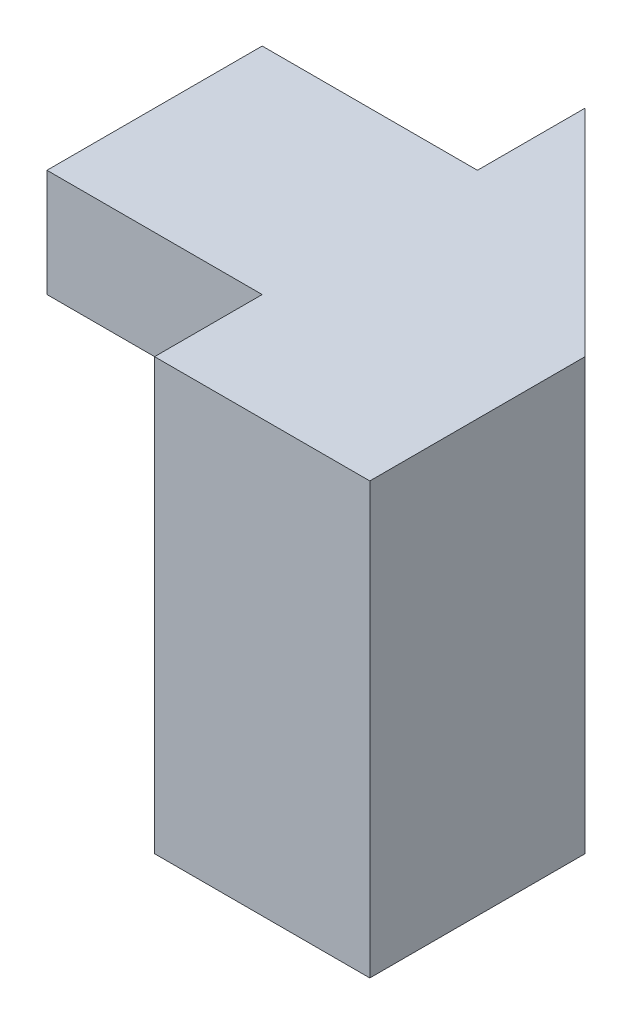
ISO-10303-21;
HEADER;
FILE_DESCRIPTION(('STEP AP214'),'2;1');
FILE_NAME('part.step','',(''),(''),'','','');
FILE_SCHEMA(('AUTOMOTIVE_DESIGN { 1 0 10303 214 1 1 1 1 }'));
ENDSEC;
DATA;
#1=APPLICATION_CONTEXT('core data for automotive mechanical design processes');
#2=APPLICATION_PROTOCOL_DEFINITION('international standard','automotive_design',2000,#1);
#3=PRODUCT_CONTEXT('',#1,'mechanical');
#4=PRODUCT('Part','Part','',(#3));
#5=PRODUCT_RELATED_PRODUCT_CATEGORY('part','',(#4));
#6=PRODUCT_DEFINITION_FORMATION('','',#4);
#7=PRODUCT_DEFINITION_CONTEXT('part definition',#1,'design');
#8=PRODUCT_DEFINITION('design','',#6,#7);
#9=PRODUCT_DEFINITION_SHAPE('','',#8);
#10=(LENGTH_UNIT() NAMED_UNIT(*) SI_UNIT(.MILLI.,.METRE.));
#11=(NAMED_UNIT(*) PLANE_ANGLE_UNIT() SI_UNIT($,.RADIAN.));
#12=(NAMED_UNIT(*) SI_UNIT($,.STERADIAN.) SOLID_ANGLE_UNIT());
#13=UNCERTAINTY_MEASURE_WITH_UNIT(LENGTH_MEASURE(1.E-05),#10,'distance_accuracy_value','');
#14=(GEOMETRIC_REPRESENTATION_CONTEXT(3) GLOBAL_UNCERTAINTY_ASSIGNED_CONTEXT((#13)) GLOBAL_UNIT_ASSIGNED_CONTEXT((#10,
#11,#12)) REPRESENTATION_CONTEXT('',''));
#15=CARTESIAN_POINT('',(0.,0.,0.));
#16=DIRECTION('',(0.,0.,1.));
#17=DIRECTION('',(1.,0.,0.));
#18=AXIS2_PLACEMENT_3D('',#15,#16,#17);
#19=CARTESIAN_POINT('',(0.,4.,-1.));
#20=DIRECTION('',(1.,0.,0.));
#21=DIRECTION('',(0.,0.,-1.));
#22=AXIS2_PLACEMENT_3D('',#19,#20,#21);
#23=PLANE('',#22);
#24=DIRECTION('',(0.,0.,1.));
#25=VECTOR('',#24,1.);
#26=CARTESIAN_POINT('',(0.,0.,-1.));
#27=LINE('',#26,#25);
#28=CARTESIAN_POINT('',(0.,0.,-2.));
#29=VERTEX_POINT('',#28);
#30=CARTESIAN_POINT('',(0.,0.,0.));
#31=VERTEX_POINT('',#30);
#32=EDGE_CURVE('E47',#29,#31,#27,.T.);
#33=ORIENTED_EDGE('',*,*,#32,.T.);
#34=DIRECTION('',(0.,-1.,0.));
#35=VECTOR('',#34,1.);
#36=CARTESIAN_POINT('',(0.,4.,0.));
#37=LINE('',#36,#35);
#38=CARTESIAN_POINT('',(0.,4.,0.));
#39=VERTEX_POINT('',#38);
#40=EDGE_CURVE('E11',#39,#31,#37,.T.);
#41=ORIENTED_EDGE('',*,*,#40,.F.);
#42=DIRECTION('',(0.,0.,1.));
#43=VECTOR('',#42,1.);
#44=CARTESIAN_POINT('',(0.,4.,-1.));
#45=LINE('',#44,#43);
#46=CARTESIAN_POINT('',(0.,4.,-1.));
#47=VERTEX_POINT('',#46);
#48=EDGE_CURVE('E135',#47,#39,#45,.T.);
#49=ORIENTED_EDGE('',*,*,#48,.F.);
#50=DIRECTION('',(0.,-1.,0.));
#51=VECTOR('',#50,1.);
#52=CARTESIAN_POINT('',(0.,4.,-1.));
#53=LINE('',#52,#51);
#54=CARTESIAN_POINT('',(0.,3.,-1.));
#55=VERTEX_POINT('',#54);
#56=EDGE_CURVE('E122',#47,#55,#53,.T.);
#57=ORIENTED_EDGE('',*,*,#56,.T.);
#58=DIRECTION('',(0.,0.,-1.));
#59=VECTOR('',#58,1.);
#60=CARTESIAN_POINT('',(0.,3.,-1.));
#61=LINE('',#60,#59);
#62=CARTESIAN_POINT('',(0.,3.,-2.));
#63=VERTEX_POINT('',#62);
#64=EDGE_CURVE('E171',#55,#63,#61,.T.);
#65=ORIENTED_EDGE('',*,*,#64,.T.);
#66=DIRECTION('',(0.,-1.,0.));
#67=VECTOR('',#66,1.);
#68=CARTESIAN_POINT('',(0.,3.,-2.));
#69=LINE('',#68,#67);
#70=EDGE_CURVE('E174',#63,#29,#69,.T.);
#71=ORIENTED_EDGE('',*,*,#70,.T.);
#72=EDGE_LOOP('',(#33,#41,#49,#57,#65,#71));
#73=FACE_BOUND('',#72,.T.);
#74=ADVANCED_FACE('F33',(#73),#23,.F.);
#75=CARTESIAN_POINT('',(0.,4.,0.));
#76=DIRECTION('',(0.,0.,-1.));
#77=DIRECTION('',(-1.,0.,0.));
#78=AXIS2_PLACEMENT_3D('',#75,#76,#77);
#79=PLANE('',#78);
#80=DIRECTION('',(1.,0.,0.));
#81=VECTOR('',#80,1.);
#82=CARTESIAN_POINT('',(0.,0.,0.));
#83=LINE('',#82,#81);
#84=CARTESIAN_POINT('',(2.,0.,0.));
#85=VERTEX_POINT('',#84);
#86=EDGE_CURVE('E124',#31,#85,#83,.T.);
#87=ORIENTED_EDGE('',*,*,#86,.T.);
#88=DIRECTION('',(0.,-1.,0.));
#89=VECTOR('',#88,1.);
#90=CARTESIAN_POINT('',(2.,4.,0.));
#91=LINE('',#90,#89);
#92=CARTESIAN_POINT('',(2.,4.,0.));
#93=VERTEX_POINT('',#92);
#94=EDGE_CURVE('E40',#93,#85,#91,.T.);
#95=ORIENTED_EDGE('',*,*,#94,.F.);
#96=DIRECTION('',(1.,0.,0.));
#97=VECTOR('',#96,1.);
#98=CARTESIAN_POINT('',(0.,4.,0.));
#99=LINE('',#98,#97);
#100=EDGE_CURVE('E85',#39,#93,#99,.T.);
#101=ORIENTED_EDGE('',*,*,#100,.F.);
#102=ORIENTED_EDGE('',*,*,#40,.T.);
#103=EDGE_LOOP('',(#87,#95,#101,#102));
#104=FACE_BOUND('',#103,.T.);
#105=ADVANCED_FACE('F191',(#104),#79,.F.);
#106=CARTESIAN_POINT('',(2.,4.,0.));
#107=DIRECTION('',(-1.,0.,0.));
#108=DIRECTION('',(0.,0.,1.));
#109=AXIS2_PLACEMENT_3D('',#106,#107,#108);
#110=PLANE('',#109);
#111=DIRECTION('',(0.,0.,-1.));
#112=VECTOR('',#111,1.);
#113=CARTESIAN_POINT('',(2.,0.,0.));
#114=LINE('',#113,#112);
#115=CARTESIAN_POINT('',(2.,0.,-2.));
#116=VERTEX_POINT('',#115);
#117=EDGE_CURVE('E109',#85,#116,#114,.T.);
#118=ORIENTED_EDGE('',*,*,#117,.T.);
#119=DIRECTION('',(0.,-1.,0.));
#120=VECTOR('',#119,1.);
#121=CARTESIAN_POINT('',(2.,4.,-2.));
#122=LINE('',#121,#120);
#123=CARTESIAN_POINT('',(2.,4.,-2.));
#124=VERTEX_POINT('',#123);
#125=EDGE_CURVE('E106',#124,#116,#122,.T.);
#126=ORIENTED_EDGE('',*,*,#125,.F.);
#127=DIRECTION('',(0.,0.,-1.));
#128=VECTOR('',#127,1.);
#129=CARTESIAN_POINT('',(2.,4.,0.));
#130=LINE('',#129,#128);
#131=EDGE_CURVE('E93',#93,#124,#130,.T.);
#132=ORIENTED_EDGE('',*,*,#131,.F.);
#133=ORIENTED_EDGE('',*,*,#94,.T.);
#134=EDGE_LOOP('',(#118,#126,#132,#133));
#135=FACE_BOUND('',#134,.T.);
#136=ADVANCED_FACE('F107',(#135),#110,.F.);
#137=CARTESIAN_POINT('',(2.,4.,-2.));
#138=DIRECTION('',(-0.707106781186547,0.,0.707106781186548));
#139=DIRECTION('',(0.707106781186548,0.,0.707106781186547));
#140=AXIS2_PLACEMENT_3D('',#137,#138,#139);
#141=PLANE('',#140);
#142=DIRECTION('',(-0.707106781186548,0.,-0.707106781186547));
#143=VECTOR('',#142,1.);
#144=CARTESIAN_POINT('',(2.,0.,-2.));
#145=LINE('',#144,#143);
#146=CARTESIAN_POINT('',(0.,0.,-4.));
#147=VERTEX_POINT('',#146);
#148=EDGE_CURVE('E128',#116,#147,#145,.T.);
#149=ORIENTED_EDGE('',*,*,#148,.T.);
#150=DIRECTION('',(0.,-1.,0.));
#151=VECTOR('',#150,1.);
#152=CARTESIAN_POINT('',(0.,4.,-4.));
#153=LINE('',#152,#151);
#154=CARTESIAN_POINT('',(0.,4.,-4.));
#155=VERTEX_POINT('',#154);
#156=EDGE_CURVE('E113',#155,#147,#153,.T.);
#157=ORIENTED_EDGE('',*,*,#156,.F.);
#158=DIRECTION('',(-0.707106781186548,0.,-0.707106781186547));
#159=VECTOR('',#158,1.);
#160=CARTESIAN_POINT('',(2.,4.,-2.));
#161=LINE('',#160,#159);
#162=EDGE_CURVE('E100',#124,#155,#161,.T.);
#163=ORIENTED_EDGE('',*,*,#162,.F.);
#164=ORIENTED_EDGE('',*,*,#125,.T.);
#165=EDGE_LOOP('',(#149,#157,#163,#164));
#166=FACE_BOUND('',#165,.T.);
#167=ADVANCED_FACE('F115',(#166),#141,.F.);
#168=CARTESIAN_POINT('',(-2.,4.,-4.));
#169=DIRECTION('',(1.,0.,0.));
#170=DIRECTION('',(0.,0.,-1.));
#171=AXIS2_PLACEMENT_3D('',#168,#169,#170);
#172=PLANE('',#171);
#173=DIRECTION('',(0.,0.,1.));
#174=VECTOR('',#173,1.);
#175=CARTESIAN_POINT('',(-2.,4.,-4.));
#176=LINE('',#175,#174);
#177=CARTESIAN_POINT('',(-2.,4.,-3.));
#178=VERTEX_POINT('',#177);
#179=CARTESIAN_POINT('',(-2.,4.,-1.));
#180=VERTEX_POINT('',#179);
#181=EDGE_CURVE('E116',#178,#180,#176,.T.);
#182=ORIENTED_EDGE('',*,*,#181,.F.);
#183=DIRECTION('',(0.,1.,0.));
#184=VECTOR('',#183,1.);
#185=CARTESIAN_POINT('',(-2.,4.,-3.));
#186=LINE('',#185,#184);
#187=CARTESIAN_POINT('',(-2.,2.,-3.));
#188=VERTEX_POINT('',#187);
#189=EDGE_CURVE('E157',#188,#178,#186,.T.);
#190=ORIENTED_EDGE('',*,*,#189,.F.);
#191=DIRECTION('',(0.,0.894427190999916,0.447213595499958));
#192=VECTOR('',#191,1.);
#193=CARTESIAN_POINT('',(-2.,2.,-3.));
#194=LINE('',#193,#192);
#195=CARTESIAN_POINT('',(-2.,0.,-4.));
#196=VERTEX_POINT('',#195);
#197=EDGE_CURVE('E149',#196,#188,#194,.T.);
#198=ORIENTED_EDGE('',*,*,#197,.F.);
#199=DIRECTION('',(0.,0.,1.));
#200=VECTOR('',#199,1.);
#201=CARTESIAN_POINT('',(-2.,0.,-4.));
#202=LINE('',#201,#200);
#203=CARTESIAN_POINT('',(-2.,0.,-2.));
#204=VERTEX_POINT('',#203);
#205=EDGE_CURVE('E132',#196,#204,#202,.T.);
#206=ORIENTED_EDGE('',*,*,#205,.T.);
#207=DIRECTION('',(0.,-1.,0.));
#208=VECTOR('',#207,1.);
#209=CARTESIAN_POINT('',(-2.,3.,-2.));
#210=LINE('',#209,#208);
#211=CARTESIAN_POINT('',(-2.,3.,-2.));
#212=VERTEX_POINT('',#211);
#213=EDGE_CURVE('E175',#212,#204,#210,.T.);
#214=ORIENTED_EDGE('',*,*,#213,.F.);
#215=DIRECTION('',(0.,0.,-1.));
#216=VECTOR('',#215,1.);
#217=CARTESIAN_POINT('',(-2.,3.,-1.));
#218=LINE('',#217,#216);
#219=CARTESIAN_POINT('',(-2.,3.,-1.));
#220=VERTEX_POINT('',#219);
#221=EDGE_CURVE('E167',#220,#212,#218,.T.);
#222=ORIENTED_EDGE('',*,*,#221,.F.);
#223=DIRECTION('',(0.,-1.,0.));
#224=VECTOR('',#223,1.);
#225=CARTESIAN_POINT('',(-2.,4.,-1.));
#226=LINE('',#225,#224);
#227=EDGE_CURVE('E138',#180,#220,#226,.T.);
#228=ORIENTED_EDGE('',*,*,#227,.F.);
#229=EDGE_LOOP('',(#182,#190,#198,#206,#214,#222,#228));
#230=FACE_BOUND('',#229,.T.);
#231=ADVANCED_FACE('F154',(#230),#172,.F.);
#232=CARTESIAN_POINT('',(-2.,4.,-1.));
#233=DIRECTION('',(0.,0.,-1.));
#234=DIRECTION('',(-1.,0.,0.));
#235=AXIS2_PLACEMENT_3D('',#232,#233,#234);
#236=PLANE('',#235);
#237=ORIENTED_EDGE('',*,*,#227,.T.);
#238=DIRECTION('',(-1.,0.,0.));
#239=VECTOR('',#238,1.);
#240=CARTESIAN_POINT('',(0.,3.,-1.));
#241=LINE('',#240,#239);
#242=EDGE_CURVE('E177',#55,#220,#241,.T.);
#243=ORIENTED_EDGE('',*,*,#242,.F.);
#244=ORIENTED_EDGE('',*,*,#56,.F.);
#245=DIRECTION('',(1.,0.,0.));
#246=VECTOR('',#245,1.);
#247=CARTESIAN_POINT('',(-2.,4.,-1.));
#248=LINE('',#247,#246);
#249=EDGE_CURVE('E56',#180,#47,#248,.T.);
#250=ORIENTED_EDGE('',*,*,#249,.F.);
#251=EDGE_LOOP('',(#237,#243,#244,#250));
#252=FACE_BOUND('',#251,.T.);
#253=ADVANCED_FACE('F203',(#252),#236,.F.);
#254=CARTESIAN_POINT('',(0.,4.,0.));
#255=DIRECTION('',(0.,1.,0.));
#256=DIRECTION('',(0.,0.,1.));
#257=AXIS2_PLACEMENT_3D('',#254,#255,#256);
#258=PLANE('',#257);
#259=DIRECTION('',(-1.,0.,0.));
#260=VECTOR('',#259,1.);
#261=CARTESIAN_POINT('',(0.,4.,-3.));
#262=LINE('',#261,#260);
#263=CARTESIAN_POINT('',(0.,4.,-3.));
#264=VERTEX_POINT('',#263);
#265=EDGE_CURVE('E165',#264,#178,#262,.T.);
#266=ORIENTED_EDGE('',*,*,#265,.T.);
#267=ORIENTED_EDGE('',*,*,#181,.T.);
#268=ORIENTED_EDGE('',*,*,#249,.T.);
#269=ORIENTED_EDGE('',*,*,#48,.T.);
#270=ORIENTED_EDGE('',*,*,#100,.T.);
#271=ORIENTED_EDGE('',*,*,#131,.T.);
#272=ORIENTED_EDGE('',*,*,#162,.T.);
#273=DIRECTION('',(0.,0.,-1.));
#274=VECTOR('',#273,1.);
#275=CARTESIAN_POINT('',(0.,4.,-4.));
#276=LINE('',#275,#274);
#277=EDGE_CURVE('E159',#264,#155,#276,.T.);
#278=ORIENTED_EDGE('',*,*,#277,.F.);
#279=EDGE_LOOP('',(#266,#267,#268,#269,#270,#271,#272,#278));
#280=FACE_BOUND('',#279,.T.);
#281=ADVANCED_FACE('F96',(#280),#258,.T.);
#282=CARTESIAN_POINT('',(0.,0.,0.));
#283=DIRECTION('',(0.,1.,0.));
#284=DIRECTION('',(0.,0.,1.));
#285=AXIS2_PLACEMENT_3D('',#282,#283,#284);
#286=PLANE('',#285);
#287=ORIENTED_EDGE('',*,*,#32,.F.);
#288=DIRECTION('',(-1.,0.,0.));
#289=VECTOR('',#288,1.);
#290=CARTESIAN_POINT('',(0.,0.,-2.));
#291=LINE('',#290,#289);
#292=EDGE_CURVE('E125',#29,#204,#291,.T.);
#293=ORIENTED_EDGE('',*,*,#292,.T.);
#294=ORIENTED_EDGE('',*,*,#205,.F.);
#295=DIRECTION('',(-1.,0.,0.));
#296=VECTOR('',#295,1.);
#297=CARTESIAN_POINT('',(0.,0.,-4.));
#298=LINE('',#297,#296);
#299=EDGE_CURVE('E130',#147,#196,#298,.T.);
#300=ORIENTED_EDGE('',*,*,#299,.F.);
#301=ORIENTED_EDGE('',*,*,#148,.F.);
#302=ORIENTED_EDGE('',*,*,#117,.F.);
#303=ORIENTED_EDGE('',*,*,#86,.F.);
#304=EDGE_LOOP('',(#287,#293,#294,#300,#301,#302,#303));
#305=FACE_BOUND('',#304,.T.);
#306=ADVANCED_FACE('F141',(#305),#286,.F.);
#307=CARTESIAN_POINT('',(0.,3.,-2.));
#308=DIRECTION('',(0.,0.,-1.));
#309=DIRECTION('',(-1.,0.,0.));
#310=AXIS2_PLACEMENT_3D('',#307,#308,#309);
#311=PLANE('',#310);
#312=ORIENTED_EDGE('',*,*,#213,.T.);
#313=ORIENTED_EDGE('',*,*,#292,.F.);
#314=ORIENTED_EDGE('',*,*,#70,.F.);
#315=DIRECTION('',(-1.,0.,0.));
#316=VECTOR('',#315,1.);
#317=CARTESIAN_POINT('',(0.,3.,-2.));
#318=LINE('',#317,#316);
#319=EDGE_CURVE('E183',#63,#212,#318,.T.);
#320=ORIENTED_EDGE('',*,*,#319,.T.);
#321=EDGE_LOOP('',(#312,#313,#314,#320));
#322=FACE_BOUND('',#321,.T.);
#323=ADVANCED_FACE('F209',(#322),#311,.F.);
#324=CARTESIAN_POINT('',(0.,3.,-1.));
#325=DIRECTION('',(0.,1.,0.));
#326=DIRECTION('',(0.,0.,1.));
#327=AXIS2_PLACEMENT_3D('',#324,#325,#326);
#328=PLANE('',#327);
#329=ORIENTED_EDGE('',*,*,#221,.T.);
#330=ORIENTED_EDGE('',*,*,#319,.F.);
#331=ORIENTED_EDGE('',*,*,#64,.F.);
#332=ORIENTED_EDGE('',*,*,#242,.T.);
#333=EDGE_LOOP('',(#329,#330,#331,#332));
#334=FACE_BOUND('',#333,.T.);
#335=ADVANCED_FACE('F212',(#334),#328,.F.);
#336=CARTESIAN_POINT('',(0.,4.,-3.));
#337=DIRECTION('',(0.,0.,1.));
#338=DIRECTION('',(1.,0.,0.));
#339=AXIS2_PLACEMENT_3D('',#336,#337,#338);
#340=PLANE('',#339);
#341=ORIENTED_EDGE('',*,*,#189,.T.);
#342=ORIENTED_EDGE('',*,*,#265,.F.);
#343=DIRECTION('',(0.,1.,0.));
#344=VECTOR('',#343,1.);
#345=CARTESIAN_POINT('',(0.,4.,-3.));
#346=LINE('',#345,#344);
#347=CARTESIAN_POINT('',(0.,2.,-3.));
#348=VERTEX_POINT('',#347);
#349=EDGE_CURVE('E162',#348,#264,#346,.T.);
#350=ORIENTED_EDGE('',*,*,#349,.F.);
#351=DIRECTION('',(-1.,0.,0.));
#352=VECTOR('',#351,1.);
#353=CARTESIAN_POINT('',(0.,2.,-3.));
#354=LINE('',#353,#352);
#355=EDGE_CURVE('E168',#348,#188,#354,.T.);
#356=ORIENTED_EDGE('',*,*,#355,.T.);
#357=EDGE_LOOP('',(#341,#342,#350,#356));
#358=FACE_BOUND('',#357,.T.);
#359=ADVANCED_FACE('F215',(#358),#340,.F.);
#360=CARTESIAN_POINT('',(0.,2.,-3.));
#361=DIRECTION('',(0.,-0.447213595499958,0.894427190999916));
#362=DIRECTION('',(0.,-0.894427190999916,-0.447213595499958));
#363=AXIS2_PLACEMENT_3D('',#360,#361,#362);
#364=PLANE('',#363);
#365=ORIENTED_EDGE('',*,*,#197,.T.);
#366=ORIENTED_EDGE('',*,*,#355,.F.);
#367=DIRECTION('',(0.,0.894427190999916,0.447213595499958));
#368=VECTOR('',#367,1.);
#369=CARTESIAN_POINT('',(0.,2.,-3.));
#370=LINE('',#369,#368);
#371=EDGE_CURVE('E77',#147,#348,#370,.T.);
#372=ORIENTED_EDGE('',*,*,#371,.F.);
#373=ORIENTED_EDGE('',*,*,#299,.T.);
#374=EDGE_LOOP('',(#365,#366,#372,#373));
#375=FACE_BOUND('',#374,.T.);
#376=ADVANCED_FACE('F147',(#375),#364,.F.);
#377=CARTESIAN_POINT('',(0.,0.,0.));
#378=DIRECTION('',(1.,0.,0.));
#379=DIRECTION('',(0.,0.,-1.));
#380=AXIS2_PLACEMENT_3D('',#377,#378,#379);
#381=PLANE('',#380);
#382=ORIENTED_EDGE('',*,*,#277,.T.);
#383=ORIENTED_EDGE('',*,*,#156,.T.);
#384=ORIENTED_EDGE('',*,*,#371,.T.);
#385=ORIENTED_EDGE('',*,*,#349,.T.);
#386=EDGE_LOOP('',(#382,#383,#384,#385));
#387=FACE_BOUND('',#386,.T.);
#388=ADVANCED_FACE('F222',(#387),#381,.F.);
#389=CLOSED_SHELL('',(#74,#105,#136,#167,#231,#253,#281,#306,#323,#335,#359,#376,#388));
#390=MANIFOLD_SOLID_BREP('B2',#389);
#391=ADVANCED_BREP_SHAPE_REPRESENTATION('',(#18,#390),#14);
#392=SHAPE_DEFINITION_REPRESENTATION(#9,#391);
ENDSEC;
END-ISO-10303-21;
